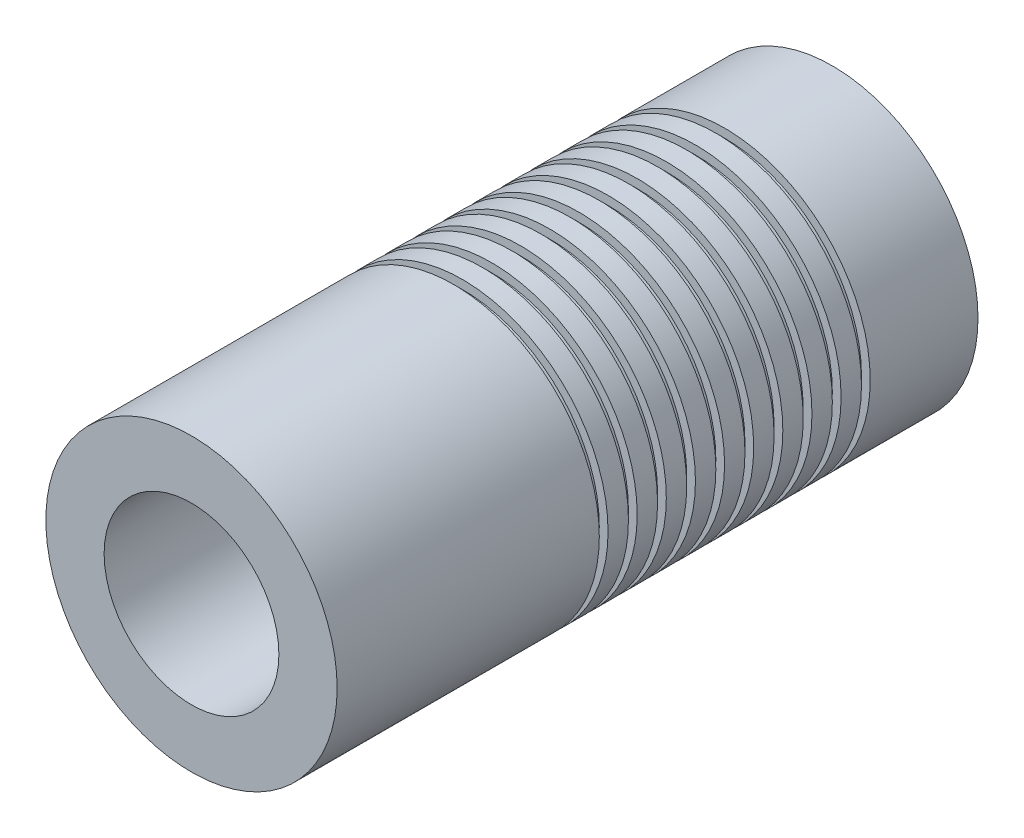
ISO-10303-21;
HEADER;
FILE_DESCRIPTION(('STEP AP214'),'2;1');
FILE_NAME('part.step','',(''),(''),'','','');
FILE_SCHEMA(('AUTOMOTIVE_DESIGN { 1 0 10303 214 1 1 1 1 }'));
ENDSEC;
DATA;
#1=APPLICATION_CONTEXT('core data for automotive mechanical design processes');
#2=APPLICATION_PROTOCOL_DEFINITION('international standard','automotive_design',2000,#1);
#3=PRODUCT_CONTEXT('',#1,'mechanical');
#4=PRODUCT('Part','Part','',(#3));
#5=PRODUCT_RELATED_PRODUCT_CATEGORY('part','',(#4));
#6=PRODUCT_DEFINITION_FORMATION('','',#4);
#7=PRODUCT_DEFINITION_CONTEXT('part definition',#1,'design');
#8=PRODUCT_DEFINITION('design','',#6,#7);
#9=PRODUCT_DEFINITION_SHAPE('','',#8);
#10=(LENGTH_UNIT() NAMED_UNIT(*) SI_UNIT(.MILLI.,.METRE.));
#11=(NAMED_UNIT(*) PLANE_ANGLE_UNIT() SI_UNIT($,.RADIAN.));
#12=(NAMED_UNIT(*) SI_UNIT($,.STERADIAN.) SOLID_ANGLE_UNIT());
#13=UNCERTAINTY_MEASURE_WITH_UNIT(LENGTH_MEASURE(1.E-05),#10,'distance_accuracy_value','');
#14=(GEOMETRIC_REPRESENTATION_CONTEXT(3) GLOBAL_UNCERTAINTY_ASSIGNED_CONTEXT((#13)) GLOBAL_UNIT_ASSIGNED_CONTEXT((#10,
#11,#12)) REPRESENTATION_CONTEXT('',''));
#15=CARTESIAN_POINT('',(0.,0.,0.));
#16=DIRECTION('',(0.,0.,1.));
#17=DIRECTION('',(1.,0.,0.));
#18=AXIS2_PLACEMENT_3D('',#15,#16,#17);
#19=CARTESIAN_POINT('',(0.,0.,9.));
#20=DIRECTION('',(0.,0.,-1.));
#21=DIRECTION('',(-1.,0.,0.));
#22=AXIS2_PLACEMENT_3D('',#19,#20,#21);
#23=CYLINDRICAL_SURFACE('',#22,5.);
#24=CARTESIAN_POINT('',(0.,0.,-1.));
#25=DIRECTION('',(0.,0.,1.));
#26=DIRECTION('',(1.,0.,0.));
#27=AXIS2_PLACEMENT_3D('',#24,#25,#26);
#28=CIRCLE('',#27,5.);
#29=CARTESIAN_POINT('',(5.,0.,-1.));
#30=VERTEX_POINT('',#29);
#31=EDGE_CURVE('E72',#30,#30,#28,.T.);
#32=ORIENTED_EDGE('',*,*,#31,.T.);
#33=EDGE_LOOP('',(#32));
#34=FACE_BOUND('',#33,.T.);
#35=CARTESIAN_POINT('',(0.,0.,-0.3));
#36=DIRECTION('',(0.,0.,1.));
#37=DIRECTION('',(1.,0.,0.));
#38=AXIS2_PLACEMENT_3D('',#35,#36,#37);
#39=CIRCLE('',#38,5.);
#40=CARTESIAN_POINT('',(5.,0.,-0.3));
#41=VERTEX_POINT('',#40);
#42=EDGE_CURVE('E57',#41,#41,#39,.T.);
#43=ORIENTED_EDGE('',*,*,#42,.F.);
#44=EDGE_LOOP('',(#43));
#45=FACE_BOUND('',#44,.T.);
#46=ADVANCED_FACE('F33',(#34,#45),#23,.T.);
#47=CARTESIAN_POINT('',(0.,0.,-0.3));
#48=DIRECTION('',(0.,0.,1.));
#49=DIRECTION('',(1.,0.,0.));
#50=AXIS2_PLACEMENT_3D('',#47,#48,#49);
#51=PLANE('',#50);
#52=CARTESIAN_POINT('',(0.,0.,-0.3));
#53=DIRECTION('',(0.,0.,1.));
#54=DIRECTION('',(1.,0.,0.));
#55=AXIS2_PLACEMENT_3D('',#52,#53,#54);
#56=CIRCLE('',#55,4.7);
#57=CARTESIAN_POINT('',(4.7,0.,-0.3));
#58=VERTEX_POINT('',#57);
#59=EDGE_CURVE('E63',#58,#58,#56,.T.);
#60=ORIENTED_EDGE('',*,*,#59,.F.);
#61=EDGE_LOOP('',(#60));
#62=FACE_BOUND('',#61,.T.);
#63=ORIENTED_EDGE('',*,*,#42,.T.);
#64=EDGE_LOOP('',(#63));
#65=FACE_BOUND('',#64,.T.);
#66=ADVANCED_FACE('F209',(#62,#65),#51,.T.);
#67=CARTESIAN_POINT('',(0.,0.,0.));
#68=DIRECTION('',(0.,0.,1.));
#69=DIRECTION('',(1.,0.,0.));
#70=AXIS2_PLACEMENT_3D('',#67,#68,#69);
#71=PLANE('',#70);
#72=CARTESIAN_POINT('',(0.,0.,0.));
#73=DIRECTION('',(0.,0.,1.));
#74=DIRECTION('',(1.,0.,0.));
#75=AXIS2_PLACEMENT_3D('',#72,#73,#74);
#76=CIRCLE('',#75,4.7);
#77=CARTESIAN_POINT('',(4.7,0.,0.));
#78=VERTEX_POINT('',#77);
#79=EDGE_CURVE('E66',#78,#78,#76,.T.);
#80=ORIENTED_EDGE('',*,*,#79,.T.);
#81=EDGE_LOOP('',(#80));
#82=FACE_BOUND('',#81,.T.);
#83=CARTESIAN_POINT('',(0.,0.,0.));
#84=DIRECTION('',(0.,0.,1.));
#85=DIRECTION('',(1.,0.,0.));
#86=AXIS2_PLACEMENT_3D('',#83,#84,#85);
#87=CIRCLE('',#86,5.);
#88=CARTESIAN_POINT('',(5.,0.,0.));
#89=VERTEX_POINT('',#88);
#90=EDGE_CURVE('E60',#89,#89,#87,.T.);
#91=ORIENTED_EDGE('',*,*,#90,.F.);
#92=EDGE_LOOP('',(#91));
#93=FACE_BOUND('',#92,.T.);
#94=ADVANCED_FACE('F215',(#82,#93),#71,.F.);
#95=CARTESIAN_POINT('',(0.,0.,-0.3));
#96=DIRECTION('',(0.,0.,1.));
#97=DIRECTION('',(1.,0.,0.));
#98=AXIS2_PLACEMENT_3D('',#95,#96,#97);
#99=CYLINDRICAL_SURFACE('',#98,4.7);
#100=ORIENTED_EDGE('',*,*,#59,.T.);
#101=EDGE_LOOP('',(#100));
#102=FACE_BOUND('',#101,.T.);
#103=ORIENTED_EDGE('',*,*,#79,.F.);
#104=EDGE_LOOP('',(#103));
#105=FACE_BOUND('',#104,.T.);
#106=ADVANCED_FACE('F360',(#102,#105),#99,.T.);
#107=CARTESIAN_POINT('',(0.,0.,4.));
#108=DIRECTION('',(0.,0.,1.));
#109=DIRECTION('',(1.,0.,0.));
#110=AXIS2_PLACEMENT_3D('',#107,#108,#109);
#111=PLANE('',#110);
#112=CARTESIAN_POINT('',(0.,0.,4.));
#113=DIRECTION('',(0.,0.,1.));
#114=DIRECTION('',(1.,0.,0.));
#115=AXIS2_PLACEMENT_3D('',#112,#113,#114);
#116=CIRCLE('',#115,3.);
#117=CARTESIAN_POINT('',(3.,0.,4.));
#118=VERTEX_POINT('',#117);
#119=EDGE_CURVE('E44',#118,#118,#116,.T.);
#120=ORIENTED_EDGE('',*,*,#119,.T.);
#121=EDGE_LOOP('',(#120));
#122=FACE_BOUND('',#121,.T.);
#123=ADVANCED_FACE('F362',(#122),#111,.T.);
#124=CARTESIAN_POINT('',(0.,0.,4.));
#125=DIRECTION('',(0.,0.,1.));
#126=DIRECTION('',(1.,0.,0.));
#127=AXIS2_PLACEMENT_3D('',#124,#125,#126);
#128=CYLINDRICAL_SURFACE('',#127,3.);
#129=ORIENTED_EDGE('',*,*,#119,.F.);
#130=EDGE_LOOP('',(#129));
#131=FACE_BOUND('',#130,.T.);
#132=CARTESIAN_POINT('',(0.,0.,9.));
#133=DIRECTION('',(0.,0.,1.));
#134=DIRECTION('',(1.,0.,0.));
#135=AXIS2_PLACEMENT_3D('',#132,#133,#134);
#136=CIRCLE('',#135,3.);
#137=CARTESIAN_POINT('',(3.,0.,9.));
#138=VERTEX_POINT('',#137);
#139=EDGE_CURVE('E48',#138,#138,#136,.T.);
#140=ORIENTED_EDGE('',*,*,#139,.T.);
#141=EDGE_LOOP('',(#140));
#142=FACE_BOUND('',#141,.T.);
#143=ADVANCED_FACE('F377',(#131,#142),#128,.F.);
#144=CARTESIAN_POINT('',(0.,0.,9.));
#145=DIRECTION('',(0.,0.,1.));
#146=DIRECTION('',(1.,0.,0.));
#147=AXIS2_PLACEMENT_3D('',#144,#145,#146);
#148=PLANE('',#147);
#149=ORIENTED_EDGE('',*,*,#139,.F.);
#150=EDGE_LOOP('',(#149));
#151=FACE_BOUND('',#150,.T.);
#152=CARTESIAN_POINT('',(0.,0.,9.));
#153=DIRECTION('',(0.,0.,1.));
#154=DIRECTION('',(1.,0.,0.));
#155=AXIS2_PLACEMENT_3D('',#152,#153,#154);
#156=CIRCLE('',#155,5.);
#157=CARTESIAN_POINT('',(5.,0.,9.));
#158=VERTEX_POINT('',#157);
#159=EDGE_CURVE('E10',#158,#158,#156,.T.);
#160=ORIENTED_EDGE('',*,*,#159,.T.);
#161=EDGE_LOOP('',(#160));
#162=FACE_BOUND('',#161,.T.);
#163=ADVANCED_FACE('F206',(#151,#162),#148,.T.);
#164=ORIENTED_EDGE('',*,*,#90,.T.);
#165=EDGE_LOOP('',(#164));
#166=FACE_BOUND('',#165,.T.);
#167=ORIENTED_EDGE('',*,*,#159,.F.);
#168=EDGE_LOOP('',(#167));
#169=FACE_BOUND('',#168,.T.);
#170=ADVANCED_FACE('F35',(#166,#169),#23,.T.);
#171=CARTESIAN_POINT('',(0.,0.,-1.3));
#172=DIRECTION('',(0.,0.,1.));
#173=DIRECTION('',(1.,0.,0.));
#174=AXIS2_PLACEMENT_3D('',#171,#172,#173);
#175=PLANE('',#174);
#176=CARTESIAN_POINT('',(0.,0.,-1.3));
#177=DIRECTION('',(0.,0.,1.));
#178=DIRECTION('',(1.,0.,0.));
#179=AXIS2_PLACEMENT_3D('',#176,#177,#178);
#180=CIRCLE('',#179,4.7);
#181=CARTESIAN_POINT('',(4.7,0.,-1.3));
#182=VERTEX_POINT('',#181);
#183=EDGE_CURVE('E75',#182,#182,#180,.T.);
#184=ORIENTED_EDGE('',*,*,#183,.F.);
#185=EDGE_LOOP('',(#184));
#186=FACE_BOUND('',#185,.T.);
#187=CARTESIAN_POINT('',(0.,0.,-1.3));
#188=DIRECTION('',(0.,0.,1.));
#189=DIRECTION('',(1.,0.,0.));
#190=AXIS2_PLACEMENT_3D('',#187,#188,#189);
#191=CIRCLE('',#190,5.);
#192=CARTESIAN_POINT('',(5.,0.,-1.3));
#193=VERTEX_POINT('',#192);
#194=EDGE_CURVE('E69',#193,#193,#191,.T.);
#195=ORIENTED_EDGE('',*,*,#194,.T.);
#196=EDGE_LOOP('',(#195));
#197=FACE_BOUND('',#196,.T.);
#198=ADVANCED_FACE('F205',(#186,#197),#175,.T.);
#199=CARTESIAN_POINT('',(0.,0.,-1.));
#200=DIRECTION('',(0.,0.,1.));
#201=DIRECTION('',(1.,0.,0.));
#202=AXIS2_PLACEMENT_3D('',#199,#200,#201);
#203=PLANE('',#202);
#204=CARTESIAN_POINT('',(0.,0.,-1.));
#205=DIRECTION('',(0.,0.,1.));
#206=DIRECTION('',(1.,0.,0.));
#207=AXIS2_PLACEMENT_3D('',#204,#205,#206);
#208=CIRCLE('',#207,4.7);
#209=CARTESIAN_POINT('',(4.7,0.,-1.));
#210=VERTEX_POINT('',#209);
#211=EDGE_CURVE('E78',#210,#210,#208,.T.);
#212=ORIENTED_EDGE('',*,*,#211,.T.);
#213=EDGE_LOOP('',(#212));
#214=FACE_BOUND('',#213,.T.);
#215=ORIENTED_EDGE('',*,*,#31,.F.);
#216=EDGE_LOOP('',(#215));
#217=FACE_BOUND('',#216,.T.);
#218=ADVANCED_FACE('F231',(#214,#217),#203,.F.);
#219=CARTESIAN_POINT('',(0.,0.,-1.3));
#220=DIRECTION('',(0.,0.,1.));
#221=DIRECTION('',(1.,0.,0.));
#222=AXIS2_PLACEMENT_3D('',#219,#220,#221);
#223=CYLINDRICAL_SURFACE('',#222,4.7);
#224=ORIENTED_EDGE('',*,*,#183,.T.);
#225=EDGE_LOOP('',(#224));
#226=FACE_BOUND('',#225,.T.);
#227=ORIENTED_EDGE('',*,*,#211,.F.);
#228=EDGE_LOOP('',(#227));
#229=FACE_BOUND('',#228,.T.);
#230=ADVANCED_FACE('F221',(#226,#229),#223,.T.);
#231=CARTESIAN_POINT('',(0.,0.,-2.));
#232=DIRECTION('',(0.,0.,1.));
#233=DIRECTION('',(1.,0.,0.));
#234=AXIS2_PLACEMENT_3D('',#231,#232,#233);
#235=CIRCLE('',#234,5.);
#236=CARTESIAN_POINT('',(5.,0.,-2.));
#237=VERTEX_POINT('',#236);
#238=EDGE_CURVE('E84',#237,#237,#235,.T.);
#239=ORIENTED_EDGE('',*,*,#238,.T.);
#240=EDGE_LOOP('',(#239));
#241=FACE_BOUND('',#240,.T.);
#242=ORIENTED_EDGE('',*,*,#194,.F.);
#243=EDGE_LOOP('',(#242));
#244=FACE_BOUND('',#243,.T.);
#245=ADVANCED_FACE('F211',(#241,#244),#23,.T.);
#246=CARTESIAN_POINT('',(0.,0.,-2.3));
#247=DIRECTION('',(0.,0.,1.));
#248=DIRECTION('',(1.,0.,0.));
#249=AXIS2_PLACEMENT_3D('',#246,#247,#248);
#250=PLANE('',#249);
#251=CARTESIAN_POINT('',(0.,0.,-2.3));
#252=DIRECTION('',(0.,0.,1.));
#253=DIRECTION('',(1.,0.,0.));
#254=AXIS2_PLACEMENT_3D('',#251,#252,#253);
#255=CIRCLE('',#254,4.7);
#256=CARTESIAN_POINT('',(4.7,0.,-2.3));
#257=VERTEX_POINT('',#256);
#258=EDGE_CURVE('E87',#257,#257,#255,.T.);
#259=ORIENTED_EDGE('',*,*,#258,.F.);
#260=EDGE_LOOP('',(#259));
#261=FACE_BOUND('',#260,.T.);
#262=CARTESIAN_POINT('',(0.,0.,-2.3));
#263=DIRECTION('',(0.,0.,1.));
#264=DIRECTION('',(1.,0.,0.));
#265=AXIS2_PLACEMENT_3D('',#262,#263,#264);
#266=CIRCLE('',#265,5.);
#267=CARTESIAN_POINT('',(5.,0.,-2.3));
#268=VERTEX_POINT('',#267);
#269=EDGE_CURVE('E81',#268,#268,#266,.T.);
#270=ORIENTED_EDGE('',*,*,#269,.T.);
#271=EDGE_LOOP('',(#270));
#272=FACE_BOUND('',#271,.T.);
#273=ADVANCED_FACE('F220',(#261,#272),#250,.T.);
#274=CARTESIAN_POINT('',(0.,0.,-2.));
#275=DIRECTION('',(0.,0.,1.));
#276=DIRECTION('',(1.,0.,0.));
#277=AXIS2_PLACEMENT_3D('',#274,#275,#276);
#278=PLANE('',#277);
#279=CARTESIAN_POINT('',(0.,0.,-2.));
#280=DIRECTION('',(0.,0.,1.));
#281=DIRECTION('',(1.,0.,0.));
#282=AXIS2_PLACEMENT_3D('',#279,#280,#281);
#283=CIRCLE('',#282,4.7);
#284=CARTESIAN_POINT('',(4.7,0.,-2.));
#285=VERTEX_POINT('',#284);
#286=EDGE_CURVE('E90',#285,#285,#283,.T.);
#287=ORIENTED_EDGE('',*,*,#286,.T.);
#288=EDGE_LOOP('',(#287));
#289=FACE_BOUND('',#288,.T.);
#290=ORIENTED_EDGE('',*,*,#238,.F.);
#291=EDGE_LOOP('',(#290));
#292=FACE_BOUND('',#291,.T.);
#293=ADVANCED_FACE('F228',(#289,#292),#278,.F.);
#294=CARTESIAN_POINT('',(0.,0.,-2.3));
#295=DIRECTION('',(0.,0.,1.));
#296=DIRECTION('',(1.,0.,0.));
#297=AXIS2_PLACEMENT_3D('',#294,#295,#296);
#298=CYLINDRICAL_SURFACE('',#297,4.7);
#299=ORIENTED_EDGE('',*,*,#258,.T.);
#300=EDGE_LOOP('',(#299));
#301=FACE_BOUND('',#300,.T.);
#302=ORIENTED_EDGE('',*,*,#286,.F.);
#303=EDGE_LOOP('',(#302));
#304=FACE_BOUND('',#303,.T.);
#305=ADVANCED_FACE('F237',(#301,#304),#298,.T.);
#306=CARTESIAN_POINT('',(0.,0.,-3.));
#307=DIRECTION('',(0.,0.,1.));
#308=DIRECTION('',(1.,0.,0.));
#309=AXIS2_PLACEMENT_3D('',#306,#307,#308);
#310=CIRCLE('',#309,5.);
#311=CARTESIAN_POINT('',(5.,0.,-3.));
#312=VERTEX_POINT('',#311);
#313=EDGE_CURVE('E96',#312,#312,#310,.T.);
#314=ORIENTED_EDGE('',*,*,#313,.T.);
#315=EDGE_LOOP('',(#314));
#316=FACE_BOUND('',#315,.T.);
#317=ORIENTED_EDGE('',*,*,#269,.F.);
#318=EDGE_LOOP('',(#317));
#319=FACE_BOUND('',#318,.T.);
#320=ADVANCED_FACE('F223',(#316,#319),#23,.T.);
#321=CARTESIAN_POINT('',(0.,0.,-3.3));
#322=DIRECTION('',(0.,0.,1.));
#323=DIRECTION('',(1.,0.,0.));
#324=AXIS2_PLACEMENT_3D('',#321,#322,#323);
#325=PLANE('',#324);
#326=CARTESIAN_POINT('',(0.,0.,-3.3));
#327=DIRECTION('',(0.,0.,1.));
#328=DIRECTION('',(1.,0.,0.));
#329=AXIS2_PLACEMENT_3D('',#326,#327,#328);
#330=CIRCLE('',#329,4.7);
#331=CARTESIAN_POINT('',(4.7,0.,-3.3));
#332=VERTEX_POINT('',#331);
#333=EDGE_CURVE('E99',#332,#332,#330,.T.);
#334=ORIENTED_EDGE('',*,*,#333,.F.);
#335=EDGE_LOOP('',(#334));
#336=FACE_BOUND('',#335,.T.);
#337=CARTESIAN_POINT('',(0.,0.,-3.3));
#338=DIRECTION('',(0.,0.,1.));
#339=DIRECTION('',(1.,0.,0.));
#340=AXIS2_PLACEMENT_3D('',#337,#338,#339);
#341=CIRCLE('',#340,5.);
#342=CARTESIAN_POINT('',(5.,0.,-3.3));
#343=VERTEX_POINT('',#342);
#344=EDGE_CURVE('E93',#343,#343,#341,.T.);
#345=ORIENTED_EDGE('',*,*,#344,.T.);
#346=EDGE_LOOP('',(#345));
#347=FACE_BOUND('',#346,.T.);
#348=ADVANCED_FACE('F236',(#336,#347),#325,.T.);
#349=CARTESIAN_POINT('',(0.,0.,-3.));
#350=DIRECTION('',(0.,0.,1.));
#351=DIRECTION('',(1.,0.,0.));
#352=AXIS2_PLACEMENT_3D('',#349,#350,#351);
#353=PLANE('',#352);
#354=CARTESIAN_POINT('',(0.,0.,-3.));
#355=DIRECTION('',(0.,0.,1.));
#356=DIRECTION('',(1.,0.,0.));
#357=AXIS2_PLACEMENT_3D('',#354,#355,#356);
#358=CIRCLE('',#357,4.7);
#359=CARTESIAN_POINT('',(4.7,0.,-3.));
#360=VERTEX_POINT('',#359);
#361=EDGE_CURVE('E102',#360,#360,#358,.T.);
#362=ORIENTED_EDGE('',*,*,#361,.T.);
#363=EDGE_LOOP('',(#362));
#364=FACE_BOUND('',#363,.T.);
#365=ORIENTED_EDGE('',*,*,#313,.F.);
#366=EDGE_LOOP('',(#365));
#367=FACE_BOUND('',#366,.T.);
#368=ADVANCED_FACE('F244',(#364,#367),#353,.F.);
#369=CARTESIAN_POINT('',(0.,0.,-3.3));
#370=DIRECTION('',(0.,0.,1.));
#371=DIRECTION('',(1.,0.,0.));
#372=AXIS2_PLACEMENT_3D('',#369,#370,#371);
#373=CYLINDRICAL_SURFACE('',#372,4.7);
#374=ORIENTED_EDGE('',*,*,#333,.T.);
#375=EDGE_LOOP('',(#374));
#376=FACE_BOUND('',#375,.T.);
#377=ORIENTED_EDGE('',*,*,#361,.F.);
#378=EDGE_LOOP('',(#377));
#379=FACE_BOUND('',#378,.T.);
#380=ADVANCED_FACE('F252',(#376,#379),#373,.T.);
#381=CARTESIAN_POINT('',(0.,0.,-4.));
#382=DIRECTION('',(0.,0.,1.));
#383=DIRECTION('',(1.,0.,0.));
#384=AXIS2_PLACEMENT_3D('',#381,#382,#383);
#385=CIRCLE('',#384,5.);
#386=CARTESIAN_POINT('',(5.,0.,-4.));
#387=VERTEX_POINT('',#386);
#388=EDGE_CURVE('E108',#387,#387,#385,.T.);
#389=ORIENTED_EDGE('',*,*,#388,.T.);
#390=EDGE_LOOP('',(#389));
#391=FACE_BOUND('',#390,.T.);
#392=ORIENTED_EDGE('',*,*,#344,.F.);
#393=EDGE_LOOP('',(#392));
#394=FACE_BOUND('',#393,.T.);
#395=ADVANCED_FACE('F239',(#391,#394),#23,.T.);
#396=CARTESIAN_POINT('',(0.,0.,-4.3));
#397=DIRECTION('',(0.,0.,1.));
#398=DIRECTION('',(1.,0.,0.));
#399=AXIS2_PLACEMENT_3D('',#396,#397,#398);
#400=PLANE('',#399);
#401=CARTESIAN_POINT('',(0.,0.,-4.3));
#402=DIRECTION('',(0.,0.,1.));
#403=DIRECTION('',(1.,0.,0.));
#404=AXIS2_PLACEMENT_3D('',#401,#402,#403);
#405=CIRCLE('',#404,4.7);
#406=CARTESIAN_POINT('',(4.7,0.,-4.3));
#407=VERTEX_POINT('',#406);
#408=EDGE_CURVE('E111',#407,#407,#405,.T.);
#409=ORIENTED_EDGE('',*,*,#408,.F.);
#410=EDGE_LOOP('',(#409));
#411=FACE_BOUND('',#410,.T.);
#412=CARTESIAN_POINT('',(0.,0.,-4.3));
#413=DIRECTION('',(0.,0.,1.));
#414=DIRECTION('',(1.,0.,0.));
#415=AXIS2_PLACEMENT_3D('',#412,#413,#414);
#416=CIRCLE('',#415,5.);
#417=CARTESIAN_POINT('',(5.,0.,-4.3));
#418=VERTEX_POINT('',#417);
#419=EDGE_CURVE('E105',#418,#418,#416,.T.);
#420=ORIENTED_EDGE('',*,*,#419,.T.);
#421=EDGE_LOOP('',(#420));
#422=FACE_BOUND('',#421,.T.);
#423=ADVANCED_FACE('F251',(#411,#422),#400,.T.);
#424=CARTESIAN_POINT('',(0.,0.,-4.));
#425=DIRECTION('',(0.,0.,1.));
#426=DIRECTION('',(1.,0.,0.));
#427=AXIS2_PLACEMENT_3D('',#424,#425,#426);
#428=PLANE('',#427);
#429=CARTESIAN_POINT('',(0.,0.,-4.));
#430=DIRECTION('',(0.,0.,1.));
#431=DIRECTION('',(1.,0.,0.));
#432=AXIS2_PLACEMENT_3D('',#429,#430,#431);
#433=CIRCLE('',#432,4.7);
#434=CARTESIAN_POINT('',(4.7,0.,-4.));
#435=VERTEX_POINT('',#434);
#436=EDGE_CURVE('E114',#435,#435,#433,.T.);
#437=ORIENTED_EDGE('',*,*,#436,.T.);
#438=EDGE_LOOP('',(#437));
#439=FACE_BOUND('',#438,.T.);
#440=ORIENTED_EDGE('',*,*,#388,.F.);
#441=EDGE_LOOP('',(#440));
#442=FACE_BOUND('',#441,.T.);
#443=ADVANCED_FACE('F259',(#439,#442),#428,.F.);
#444=CARTESIAN_POINT('',(0.,0.,-4.3));
#445=DIRECTION('',(0.,0.,1.));
#446=DIRECTION('',(1.,0.,0.));
#447=AXIS2_PLACEMENT_3D('',#444,#445,#446);
#448=CYLINDRICAL_SURFACE('',#447,4.7);
#449=ORIENTED_EDGE('',*,*,#408,.T.);
#450=EDGE_LOOP('',(#449));
#451=FACE_BOUND('',#450,.T.);
#452=ORIENTED_EDGE('',*,*,#436,.F.);
#453=EDGE_LOOP('',(#452));
#454=FACE_BOUND('',#453,.T.);
#455=ADVANCED_FACE('F267',(#451,#454),#448,.T.);
#456=CARTESIAN_POINT('',(0.,0.,-5.));
#457=DIRECTION('',(0.,0.,1.));
#458=DIRECTION('',(1.,0.,0.));
#459=AXIS2_PLACEMENT_3D('',#456,#457,#458);
#460=CIRCLE('',#459,5.);
#461=CARTESIAN_POINT('',(5.,0.,-5.));
#462=VERTEX_POINT('',#461);
#463=EDGE_CURVE('E120',#462,#462,#460,.T.);
#464=ORIENTED_EDGE('',*,*,#463,.T.);
#465=EDGE_LOOP('',(#464));
#466=FACE_BOUND('',#465,.T.);
#467=ORIENTED_EDGE('',*,*,#419,.F.);
#468=EDGE_LOOP('',(#467));
#469=FACE_BOUND('',#468,.T.);
#470=ADVANCED_FACE('F254',(#466,#469),#23,.T.);
#471=CARTESIAN_POINT('',(0.,0.,-5.3));
#472=DIRECTION('',(0.,0.,1.));
#473=DIRECTION('',(1.,0.,0.));
#474=AXIS2_PLACEMENT_3D('',#471,#472,#473);
#475=PLANE('',#474);
#476=CARTESIAN_POINT('',(0.,0.,-5.3));
#477=DIRECTION('',(0.,0.,1.));
#478=DIRECTION('',(1.,0.,0.));
#479=AXIS2_PLACEMENT_3D('',#476,#477,#478);
#480=CIRCLE('',#479,4.7);
#481=CARTESIAN_POINT('',(4.7,0.,-5.3));
#482=VERTEX_POINT('',#481);
#483=EDGE_CURVE('E123',#482,#482,#480,.T.);
#484=ORIENTED_EDGE('',*,*,#483,.F.);
#485=EDGE_LOOP('',(#484));
#486=FACE_BOUND('',#485,.T.);
#487=CARTESIAN_POINT('',(0.,0.,-5.3));
#488=DIRECTION('',(0.,0.,1.));
#489=DIRECTION('',(1.,0.,0.));
#490=AXIS2_PLACEMENT_3D('',#487,#488,#489);
#491=CIRCLE('',#490,5.);
#492=CARTESIAN_POINT('',(5.,0.,-5.3));
#493=VERTEX_POINT('',#492);
#494=EDGE_CURVE('E117',#493,#493,#491,.T.);
#495=ORIENTED_EDGE('',*,*,#494,.T.);
#496=EDGE_LOOP('',(#495));
#497=FACE_BOUND('',#496,.T.);
#498=ADVANCED_FACE('F266',(#486,#497),#475,.T.);
#499=CARTESIAN_POINT('',(0.,0.,-5.));
#500=DIRECTION('',(0.,0.,1.));
#501=DIRECTION('',(1.,0.,0.));
#502=AXIS2_PLACEMENT_3D('',#499,#500,#501);
#503=PLANE('',#502);
#504=CARTESIAN_POINT('',(0.,0.,-5.));
#505=DIRECTION('',(0.,0.,1.));
#506=DIRECTION('',(1.,0.,0.));
#507=AXIS2_PLACEMENT_3D('',#504,#505,#506);
#508=CIRCLE('',#507,4.7);
#509=CARTESIAN_POINT('',(4.7,0.,-5.));
#510=VERTEX_POINT('',#509);
#511=EDGE_CURVE('E126',#510,#510,#508,.T.);
#512=ORIENTED_EDGE('',*,*,#511,.T.);
#513=EDGE_LOOP('',(#512));
#514=FACE_BOUND('',#513,.T.);
#515=ORIENTED_EDGE('',*,*,#463,.F.);
#516=EDGE_LOOP('',(#515));
#517=FACE_BOUND('',#516,.T.);
#518=ADVANCED_FACE('F274',(#514,#517),#503,.F.);
#519=CARTESIAN_POINT('',(0.,0.,-5.3));
#520=DIRECTION('',(0.,0.,1.));
#521=DIRECTION('',(1.,0.,0.));
#522=AXIS2_PLACEMENT_3D('',#519,#520,#521);
#523=CYLINDRICAL_SURFACE('',#522,4.7);
#524=ORIENTED_EDGE('',*,*,#483,.T.);
#525=EDGE_LOOP('',(#524));
#526=FACE_BOUND('',#525,.T.);
#527=ORIENTED_EDGE('',*,*,#511,.F.);
#528=EDGE_LOOP('',(#527));
#529=FACE_BOUND('',#528,.T.);
#530=ADVANCED_FACE('F282',(#526,#529),#523,.T.);
#531=CARTESIAN_POINT('',(0.,0.,-6.));
#532=DIRECTION('',(0.,0.,1.));
#533=DIRECTION('',(1.,0.,0.));
#534=AXIS2_PLACEMENT_3D('',#531,#532,#533);
#535=CIRCLE('',#534,5.);
#536=CARTESIAN_POINT('',(5.,0.,-6.));
#537=VERTEX_POINT('',#536);
#538=EDGE_CURVE('E132',#537,#537,#535,.T.);
#539=ORIENTED_EDGE('',*,*,#538,.T.);
#540=EDGE_LOOP('',(#539));
#541=FACE_BOUND('',#540,.T.);
#542=ORIENTED_EDGE('',*,*,#494,.F.);
#543=EDGE_LOOP('',(#542));
#544=FACE_BOUND('',#543,.T.);
#545=ADVANCED_FACE('F269',(#541,#544),#23,.T.);
#546=CARTESIAN_POINT('',(0.,0.,-6.3));
#547=DIRECTION('',(0.,0.,1.));
#548=DIRECTION('',(1.,0.,0.));
#549=AXIS2_PLACEMENT_3D('',#546,#547,#548);
#550=PLANE('',#549);
#551=CARTESIAN_POINT('',(0.,0.,-6.3));
#552=DIRECTION('',(0.,0.,1.));
#553=DIRECTION('',(1.,0.,0.));
#554=AXIS2_PLACEMENT_3D('',#551,#552,#553);
#555=CIRCLE('',#554,4.7);
#556=CARTESIAN_POINT('',(4.7,0.,-6.3));
#557=VERTEX_POINT('',#556);
#558=EDGE_CURVE('E135',#557,#557,#555,.T.);
#559=ORIENTED_EDGE('',*,*,#558,.F.);
#560=EDGE_LOOP('',(#559));
#561=FACE_BOUND('',#560,.T.);
#562=CARTESIAN_POINT('',(0.,0.,-6.3));
#563=DIRECTION('',(0.,0.,1.));
#564=DIRECTION('',(1.,0.,0.));
#565=AXIS2_PLACEMENT_3D('',#562,#563,#564);
#566=CIRCLE('',#565,5.);
#567=CARTESIAN_POINT('',(5.,0.,-6.3));
#568=VERTEX_POINT('',#567);
#569=EDGE_CURVE('E129',#568,#568,#566,.T.);
#570=ORIENTED_EDGE('',*,*,#569,.T.);
#571=EDGE_LOOP('',(#570));
#572=FACE_BOUND('',#571,.T.);
#573=ADVANCED_FACE('F281',(#561,#572),#550,.T.);
#574=CARTESIAN_POINT('',(0.,0.,-6.));
#575=DIRECTION('',(0.,0.,1.));
#576=DIRECTION('',(1.,0.,0.));
#577=AXIS2_PLACEMENT_3D('',#574,#575,#576);
#578=PLANE('',#577);
#579=CARTESIAN_POINT('',(0.,0.,-6.));
#580=DIRECTION('',(0.,0.,1.));
#581=DIRECTION('',(1.,0.,0.));
#582=AXIS2_PLACEMENT_3D('',#579,#580,#581);
#583=CIRCLE('',#582,4.7);
#584=CARTESIAN_POINT('',(4.7,0.,-6.));
#585=VERTEX_POINT('',#584);
#586=EDGE_CURVE('E138',#585,#585,#583,.T.);
#587=ORIENTED_EDGE('',*,*,#586,.T.);
#588=EDGE_LOOP('',(#587));
#589=FACE_BOUND('',#588,.T.);
#590=ORIENTED_EDGE('',*,*,#538,.F.);
#591=EDGE_LOOP('',(#590));
#592=FACE_BOUND('',#591,.T.);
#593=ADVANCED_FACE('F289',(#589,#592),#578,.F.);
#594=CARTESIAN_POINT('',(0.,0.,-6.3));
#595=DIRECTION('',(0.,0.,1.));
#596=DIRECTION('',(1.,0.,0.));
#597=AXIS2_PLACEMENT_3D('',#594,#595,#596);
#598=CYLINDRICAL_SURFACE('',#597,4.7);
#599=ORIENTED_EDGE('',*,*,#558,.T.);
#600=EDGE_LOOP('',(#599));
#601=FACE_BOUND('',#600,.T.);
#602=ORIENTED_EDGE('',*,*,#586,.F.);
#603=EDGE_LOOP('',(#602));
#604=FACE_BOUND('',#603,.T.);
#605=ADVANCED_FACE('F297',(#601,#604),#598,.T.);
#606=CARTESIAN_POINT('',(0.,0.,-7.));
#607=DIRECTION('',(0.,0.,1.));
#608=DIRECTION('',(1.,0.,0.));
#609=AXIS2_PLACEMENT_3D('',#606,#607,#608);
#610=CIRCLE('',#609,5.);
#611=CARTESIAN_POINT('',(5.,0.,-7.));
#612=VERTEX_POINT('',#611);
#613=EDGE_CURVE('E144',#612,#612,#610,.T.);
#614=ORIENTED_EDGE('',*,*,#613,.T.);
#615=EDGE_LOOP('',(#614));
#616=FACE_BOUND('',#615,.T.);
#617=ORIENTED_EDGE('',*,*,#569,.F.);
#618=EDGE_LOOP('',(#617));
#619=FACE_BOUND('',#618,.T.);
#620=ADVANCED_FACE('F284',(#616,#619),#23,.T.);
#621=CARTESIAN_POINT('',(0.,0.,-7.3));
#622=DIRECTION('',(0.,0.,1.));
#623=DIRECTION('',(1.,0.,0.));
#624=AXIS2_PLACEMENT_3D('',#621,#622,#623);
#625=PLANE('',#624);
#626=CARTESIAN_POINT('',(0.,0.,-7.3));
#627=DIRECTION('',(0.,0.,1.));
#628=DIRECTION('',(1.,0.,0.));
#629=AXIS2_PLACEMENT_3D('',#626,#627,#628);
#630=CIRCLE('',#629,4.7);
#631=CARTESIAN_POINT('',(4.7,0.,-7.3));
#632=VERTEX_POINT('',#631);
#633=EDGE_CURVE('E147',#632,#632,#630,.T.);
#634=ORIENTED_EDGE('',*,*,#633,.F.);
#635=EDGE_LOOP('',(#634));
#636=FACE_BOUND('',#635,.T.);
#637=CARTESIAN_POINT('',(0.,0.,-7.3));
#638=DIRECTION('',(0.,0.,1.));
#639=DIRECTION('',(1.,0.,0.));
#640=AXIS2_PLACEMENT_3D('',#637,#638,#639);
#641=CIRCLE('',#640,5.);
#642=CARTESIAN_POINT('',(5.,0.,-7.3));
#643=VERTEX_POINT('',#642);
#644=EDGE_CURVE('E141',#643,#643,#641,.T.);
#645=ORIENTED_EDGE('',*,*,#644,.T.);
#646=EDGE_LOOP('',(#645));
#647=FACE_BOUND('',#646,.T.);
#648=ADVANCED_FACE('F296',(#636,#647),#625,.T.);
#649=CARTESIAN_POINT('',(0.,0.,-7.));
#650=DIRECTION('',(0.,0.,1.));
#651=DIRECTION('',(1.,0.,0.));
#652=AXIS2_PLACEMENT_3D('',#649,#650,#651);
#653=PLANE('',#652);
#654=CARTESIAN_POINT('',(0.,0.,-7.));
#655=DIRECTION('',(0.,0.,1.));
#656=DIRECTION('',(1.,0.,0.));
#657=AXIS2_PLACEMENT_3D('',#654,#655,#656);
#658=CIRCLE('',#657,4.7);
#659=CARTESIAN_POINT('',(4.7,0.,-7.));
#660=VERTEX_POINT('',#659);
#661=EDGE_CURVE('E150',#660,#660,#658,.T.);
#662=ORIENTED_EDGE('',*,*,#661,.T.);
#663=EDGE_LOOP('',(#662));
#664=FACE_BOUND('',#663,.T.);
#665=ORIENTED_EDGE('',*,*,#613,.F.);
#666=EDGE_LOOP('',(#665));
#667=FACE_BOUND('',#666,.T.);
#668=ADVANCED_FACE('F303',(#664,#667),#653,.F.);
#669=CARTESIAN_POINT('',(0.,0.,-7.3));
#670=DIRECTION('',(0.,0.,1.));
#671=DIRECTION('',(1.,0.,0.));
#672=AXIS2_PLACEMENT_3D('',#669,#670,#671);
#673=CYLINDRICAL_SURFACE('',#672,4.7);
#674=ORIENTED_EDGE('',*,*,#633,.T.);
#675=EDGE_LOOP('',(#674));
#676=FACE_BOUND('',#675,.T.);
#677=ORIENTED_EDGE('',*,*,#661,.F.);
#678=EDGE_LOOP('',(#677));
#679=FACE_BOUND('',#678,.T.);
#680=ADVANCED_FACE('F311',(#676,#679),#673,.T.);
#681=CARTESIAN_POINT('',(0.,0.,-8.));
#682=DIRECTION('',(0.,0.,1.));
#683=DIRECTION('',(1.,0.,0.));
#684=AXIS2_PLACEMENT_3D('',#681,#682,#683);
#685=CIRCLE('',#684,5.);
#686=CARTESIAN_POINT('',(5.,0.,-8.));
#687=VERTEX_POINT('',#686);
#688=EDGE_CURVE('E156',#687,#687,#685,.T.);
#689=ORIENTED_EDGE('',*,*,#688,.T.);
#690=EDGE_LOOP('',(#689));
#691=FACE_BOUND('',#690,.T.);
#692=ORIENTED_EDGE('',*,*,#644,.F.);
#693=EDGE_LOOP('',(#692));
#694=FACE_BOUND('',#693,.T.);
#695=ADVANCED_FACE('F203',(#691,#694),#23,.T.);
#696=CARTESIAN_POINT('',(0.,0.,-8.3));
#697=DIRECTION('',(0.,0.,1.));
#698=DIRECTION('',(1.,0.,0.));
#699=AXIS2_PLACEMENT_3D('',#696,#697,#698);
#700=PLANE('',#699);
#701=CARTESIAN_POINT('',(0.,0.,-8.3));
#702=DIRECTION('',(0.,0.,1.));
#703=DIRECTION('',(1.,0.,0.));
#704=AXIS2_PLACEMENT_3D('',#701,#702,#703);
#705=CIRCLE('',#704,4.7);
#706=CARTESIAN_POINT('',(4.7,0.,-8.3));
#707=VERTEX_POINT('',#706);
#708=EDGE_CURVE('E159',#707,#707,#705,.T.);
#709=ORIENTED_EDGE('',*,*,#708,.F.);
#710=EDGE_LOOP('',(#709));
#711=FACE_BOUND('',#710,.T.);
#712=CARTESIAN_POINT('',(0.,0.,-8.3));
#713=DIRECTION('',(0.,0.,1.));
#714=DIRECTION('',(1.,0.,0.));
#715=AXIS2_PLACEMENT_3D('',#712,#713,#714);
#716=CIRCLE('',#715,5.);
#717=CARTESIAN_POINT('',(5.,0.,-8.3));
#718=VERTEX_POINT('',#717);
#719=EDGE_CURVE('E153',#718,#718,#716,.T.);
#720=ORIENTED_EDGE('',*,*,#719,.T.);
#721=EDGE_LOOP('',(#720));
#722=FACE_BOUND('',#721,.T.);
#723=ADVANCED_FACE('F310',(#711,#722),#700,.T.);
#724=CARTESIAN_POINT('',(0.,0.,-8.));
#725=DIRECTION('',(0.,0.,1.));
#726=DIRECTION('',(1.,0.,0.));
#727=AXIS2_PLACEMENT_3D('',#724,#725,#726);
#728=PLANE('',#727);
#729=CARTESIAN_POINT('',(0.,0.,-8.));
#730=DIRECTION('',(0.,0.,1.));
#731=DIRECTION('',(1.,0.,0.));
#732=AXIS2_PLACEMENT_3D('',#729,#730,#731);
#733=CIRCLE('',#732,4.7);
#734=CARTESIAN_POINT('',(4.7,0.,-8.));
#735=VERTEX_POINT('',#734);
#736=EDGE_CURVE('E162',#735,#735,#733,.T.);
#737=ORIENTED_EDGE('',*,*,#736,.T.);
#738=EDGE_LOOP('',(#737));
#739=FACE_BOUND('',#738,.T.);
#740=ORIENTED_EDGE('',*,*,#688,.F.);
#741=EDGE_LOOP('',(#740));
#742=FACE_BOUND('',#741,.T.);
#743=ADVANCED_FACE('F317',(#739,#742),#728,.F.);
#744=CARTESIAN_POINT('',(0.,0.,-8.3));
#745=DIRECTION('',(0.,0.,1.));
#746=DIRECTION('',(1.,0.,0.));
#747=AXIS2_PLACEMENT_3D('',#744,#745,#746);
#748=CYLINDRICAL_SURFACE('',#747,4.7);
#749=ORIENTED_EDGE('',*,*,#708,.T.);
#750=EDGE_LOOP('',(#749));
#751=FACE_BOUND('',#750,.T.);
#752=ORIENTED_EDGE('',*,*,#736,.F.);
#753=EDGE_LOOP('',(#752));
#754=FACE_BOUND('',#753,.T.);
#755=ADVANCED_FACE('F201',(#751,#754),#748,.T.);
#756=CARTESIAN_POINT('',(0.,0.,-9.));
#757=DIRECTION('',(0.,0.,1.));
#758=DIRECTION('',(1.,0.,0.));
#759=AXIS2_PLACEMENT_3D('',#756,#757,#758);
#760=CIRCLE('',#759,5.);
#761=CARTESIAN_POINT('',(5.,0.,-9.));
#762=VERTEX_POINT('',#761);
#763=EDGE_CURVE('E168',#762,#762,#760,.T.);
#764=ORIENTED_EDGE('',*,*,#763,.T.);
#765=EDGE_LOOP('',(#764));
#766=FACE_BOUND('',#765,.T.);
#767=ORIENTED_EDGE('',*,*,#719,.F.);
#768=EDGE_LOOP('',(#767));
#769=FACE_BOUND('',#768,.T.);
#770=ADVANCED_FACE('F187',(#766,#769),#23,.T.);
#771=CARTESIAN_POINT('',(0.,0.,-9.3));
#772=DIRECTION('',(0.,0.,1.));
#773=DIRECTION('',(1.,0.,0.));
#774=AXIS2_PLACEMENT_3D('',#771,#772,#773);
#775=PLANE('',#774);
#776=CARTESIAN_POINT('',(0.,0.,-9.3));
#777=DIRECTION('',(0.,0.,1.));
#778=DIRECTION('',(1.,0.,0.));
#779=AXIS2_PLACEMENT_3D('',#776,#777,#778);
#780=CIRCLE('',#779,4.7);
#781=CARTESIAN_POINT('',(4.7,0.,-9.3));
#782=VERTEX_POINT('',#781);
#783=EDGE_CURVE('E171',#782,#782,#780,.T.);
#784=ORIENTED_EDGE('',*,*,#783,.F.);
#785=EDGE_LOOP('',(#784));
#786=FACE_BOUND('',#785,.T.);
#787=CARTESIAN_POINT('',(0.,0.,-9.3));
#788=DIRECTION('',(0.,0.,1.));
#789=DIRECTION('',(1.,0.,0.));
#790=AXIS2_PLACEMENT_3D('',#787,#788,#789);
#791=CIRCLE('',#790,5.);
#792=CARTESIAN_POINT('',(5.,0.,-9.3));
#793=VERTEX_POINT('',#792);
#794=EDGE_CURVE('E165',#793,#793,#791,.T.);
#795=ORIENTED_EDGE('',*,*,#794,.T.);
#796=EDGE_LOOP('',(#795));
#797=FACE_BOUND('',#796,.T.);
#798=ADVANCED_FACE('F183',(#786,#797),#775,.T.);
#799=CARTESIAN_POINT('',(0.,0.,-9.));
#800=DIRECTION('',(0.,0.,1.));
#801=DIRECTION('',(1.,0.,0.));
#802=AXIS2_PLACEMENT_3D('',#799,#800,#801);
#803=PLANE('',#802);
#804=CARTESIAN_POINT('',(0.,0.,-9.));
#805=DIRECTION('',(0.,0.,1.));
#806=DIRECTION('',(1.,0.,0.));
#807=AXIS2_PLACEMENT_3D('',#804,#805,#806);
#808=CIRCLE('',#807,4.7);
#809=CARTESIAN_POINT('',(4.7,0.,-9.));
#810=VERTEX_POINT('',#809);
#811=EDGE_CURVE('E174',#810,#810,#808,.T.);
#812=ORIENTED_EDGE('',*,*,#811,.T.);
#813=EDGE_LOOP('',(#812));
#814=FACE_BOUND('',#813,.T.);
#815=ORIENTED_EDGE('',*,*,#763,.F.);
#816=EDGE_LOOP('',(#815));
#817=FACE_BOUND('',#816,.T.);
#818=ADVANCED_FACE('F186',(#814,#817),#803,.F.);
#819=CARTESIAN_POINT('',(0.,0.,-9.3));
#820=DIRECTION('',(0.,0.,1.));
#821=DIRECTION('',(1.,0.,0.));
#822=AXIS2_PLACEMENT_3D('',#819,#820,#821);
#823=CYLINDRICAL_SURFACE('',#822,4.7);
#824=ORIENTED_EDGE('',*,*,#783,.T.);
#825=EDGE_LOOP('',(#824));
#826=FACE_BOUND('',#825,.T.);
#827=ORIENTED_EDGE('',*,*,#811,.F.);
#828=EDGE_LOOP('',(#827));
#829=FACE_BOUND('',#828,.T.);
#830=ADVANCED_FACE('F180',(#826,#829),#823,.T.);
#831=CARTESIAN_POINT('',(0.,0.,-8.));
#832=DIRECTION('',(0.,0.,-1.));
#833=DIRECTION('',(-1.,0.,0.));
#834=AXIS2_PLACEMENT_3D('',#831,#832,#833);
#835=PLANE('',#834);
#836=CARTESIAN_POINT('',(0.,0.,-8.));
#837=DIRECTION('',(0.,0.,-1.));
#838=DIRECTION('',(-1.,0.,0.));
#839=AXIS2_PLACEMENT_3D('',#836,#837,#838);
#840=CIRCLE('',#839,4.);
#841=CARTESIAN_POINT('',(-4.,0.,-8.));
#842=VERTEX_POINT('',#841);
#843=EDGE_CURVE('E52',#842,#842,#840,.T.);
#844=ORIENTED_EDGE('',*,*,#843,.T.);
#845=EDGE_LOOP('',(#844));
#846=FACE_BOUND('',#845,.T.);
#847=ADVANCED_FACE('F368',(#846),#835,.T.);
#848=CARTESIAN_POINT('',(0.,0.,-8.));
#849=DIRECTION('',(0.,0.,-1.));
#850=DIRECTION('',(-1.,0.,0.));
#851=AXIS2_PLACEMENT_3D('',#848,#849,#850);
#852=CYLINDRICAL_SURFACE('',#851,4.);
#853=ORIENTED_EDGE('',*,*,#843,.F.);
#854=EDGE_LOOP('',(#853));
#855=FACE_BOUND('',#854,.T.);
#856=CARTESIAN_POINT('',(0.,0.,-13.));
#857=DIRECTION('',(0.,0.,-1.));
#858=DIRECTION('',(-1.,0.,0.));
#859=AXIS2_PLACEMENT_3D('',#856,#857,#858);
#860=CIRCLE('',#859,4.);
#861=CARTESIAN_POINT('',(-4.,0.,-13.));
#862=VERTEX_POINT('',#861);
#863=EDGE_CURVE('E54',#862,#862,#860,.T.);
#864=ORIENTED_EDGE('',*,*,#863,.T.);
#865=EDGE_LOOP('',(#864));
#866=FACE_BOUND('',#865,.T.);
#867=ADVANCED_FACE('F197',(#855,#866),#852,.F.);
#868=CARTESIAN_POINT('',(0.,0.,-13.));
#869=DIRECTION('',(0.,0.,1.));
#870=DIRECTION('',(1.,0.,0.));
#871=AXIS2_PLACEMENT_3D('',#868,#869,#870);
#872=PLANE('',#871);
#873=ORIENTED_EDGE('',*,*,#863,.F.);
#874=EDGE_LOOP('',(#873));
#875=FACE_BOUND('',#874,.T.);
#876=CARTESIAN_POINT('',(0.,0.,-13.));
#877=DIRECTION('',(0.,0.,1.));
#878=DIRECTION('',(1.,0.,0.));
#879=AXIS2_PLACEMENT_3D('',#876,#877,#878);
#880=CIRCLE('',#879,5.);
#881=CARTESIAN_POINT('',(5.,0.,-13.));
#882=VERTEX_POINT('',#881);
#883=EDGE_CURVE('E40',#882,#882,#880,.T.);
#884=ORIENTED_EDGE('',*,*,#883,.F.);
#885=EDGE_LOOP('',(#884));
#886=FACE_BOUND('',#885,.T.);
#887=ADVANCED_FACE('F193',(#875,#886),#872,.F.);
#888=ORIENTED_EDGE('',*,*,#883,.T.);
#889=EDGE_LOOP('',(#888));
#890=FACE_BOUND('',#889,.T.);
#891=ORIENTED_EDGE('',*,*,#794,.F.);
#892=EDGE_LOOP('',(#891));
#893=FACE_BOUND('',#892,.T.);
#894=ADVANCED_FACE('F191',(#890,#893),#23,.T.);
#895=CLOSED_SHELL('',(#46,#66,#94,#106,#123,#143,#163,#170,#198,#218,#230,#245,#273,#293,#305,
#320,#348,#368,#380,#395,#423,#443,#455,#470,#498,#518,#530,#545,#573,#593,#605,#620,#648,#668,
#680,#695,#723,#743,#755,#770,#798,#818,#830,#847,#867,#887,#894));
#896=MANIFOLD_SOLID_BREP('B2',#895);
#897=ADVANCED_BREP_SHAPE_REPRESENTATION('',(#18,#896),#14);
#898=SHAPE_DEFINITION_REPRESENTATION(#9,#897);
ENDSEC;
END-ISO-10303-21;
